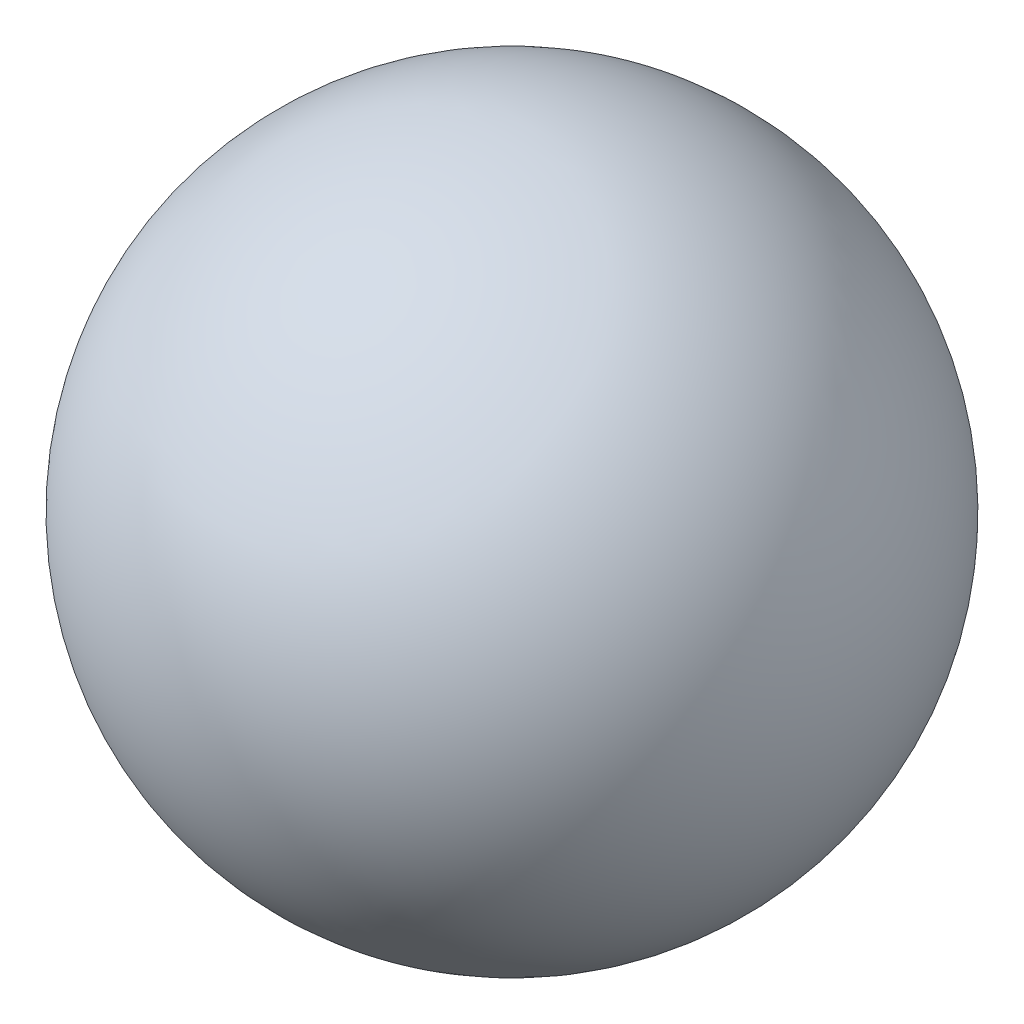
ISO-10303-21;
HEADER;
FILE_DESCRIPTION(('STEP AP214'),'2;1');
FILE_NAME('part.step','',(''),(''),'','','');
FILE_SCHEMA(('AUTOMOTIVE_DESIGN { 1 0 10303 214 1 1 1 1 }'));
ENDSEC;
DATA;
#1=APPLICATION_CONTEXT('core data for automotive mechanical design processes');
#2=APPLICATION_PROTOCOL_DEFINITION('international standard','automotive_design',2000,#1);
#3=PRODUCT_CONTEXT('',#1,'mechanical');
#4=PRODUCT('Part','Part','',(#3));
#5=PRODUCT_RELATED_PRODUCT_CATEGORY('part','',(#4));
#6=PRODUCT_DEFINITION_FORMATION('','',#4);
#7=PRODUCT_DEFINITION_CONTEXT('part definition',#1,'design');
#8=PRODUCT_DEFINITION('design','',#6,#7);
#9=PRODUCT_DEFINITION_SHAPE('','',#8);
#10=(LENGTH_UNIT() NAMED_UNIT(*) SI_UNIT(.MILLI.,.METRE.));
#11=(NAMED_UNIT(*) PLANE_ANGLE_UNIT() SI_UNIT($,.RADIAN.));
#12=(NAMED_UNIT(*) SI_UNIT($,.STERADIAN.) SOLID_ANGLE_UNIT());
#13=UNCERTAINTY_MEASURE_WITH_UNIT(LENGTH_MEASURE(1.E-05),#10,'distance_accuracy_value','');
#14=(GEOMETRIC_REPRESENTATION_CONTEXT(3) GLOBAL_UNCERTAINTY_ASSIGNED_CONTEXT((#13)) GLOBAL_UNIT_ASSIGNED_CONTEXT((#10,
#11,#12)) REPRESENTATION_CONTEXT('',''));
#15=CARTESIAN_POINT('',(0.,0.,0.));
#16=DIRECTION('',(0.,0.,1.));
#17=DIRECTION('',(1.,0.,0.));
#18=AXIS2_PLACEMENT_3D('',#15,#16,#17);
#19=CARTESIAN_POINT('',(67.76,-65.5436081102382,22.6519577993056));
#20=DIRECTION('',(0.,-0.945147382533446,0.326644187595885));
#21=DIRECTION('',(0.173648177666934,-0.321681728420802,-0.930788470058132));
#22=AXIS2_PLACEMENT_3D('',#19,#20,#21);
#23=SPHERICAL_SURFACE('',#22,7.15);
#24=CARTESIAN_POINT('',(67.76,-72.3014118953523,24.9874637406162));
#25=VERTEX_POINT('',#24);
#26=VERTEX_LOOP('',#25);
#27=FACE_BOUND('',#26,.T.);
#28=CARTESIAN_POINT('',(67.76,-58.7858043251241,20.316451857995));
#29=VERTEX_POINT('',#28);
#30=VERTEX_LOOP('',#29);
#31=FACE_BOUND('',#30,.T.);
#32=ADVANCED_FACE('F16',(#27,#31),#23,.T.);
#33=CLOSED_SHELL('',(#32));
#34=MANIFOLD_SOLID_BREP('B1',#33);
#35=ADVANCED_BREP_SHAPE_REPRESENTATION('',(#18,#34),#14);
#36=SHAPE_DEFINITION_REPRESENTATION(#9,#35);
ENDSEC;
END-ISO-10303-21;
